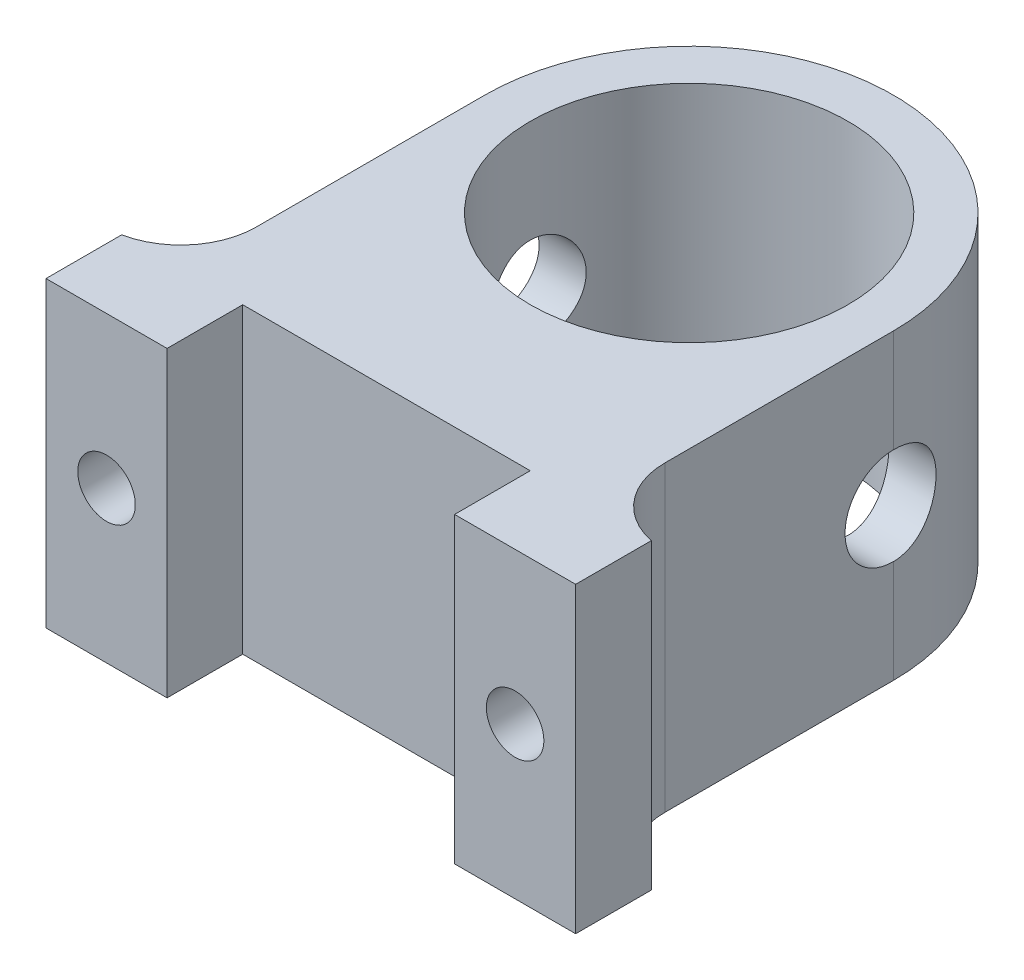
ISO-10303-21;
HEADER;
FILE_DESCRIPTION(('STEP AP214'),'2;1');
FILE_NAME('part.step','',(''),(''),'','','');
FILE_SCHEMA(('AUTOMOTIVE_DESIGN { 1 0 10303 214 1 1 1 1 }'));
ENDSEC;
DATA;
#1=APPLICATION_CONTEXT('core data for automotive mechanical design processes');
#2=APPLICATION_PROTOCOL_DEFINITION('international standard','automotive_design',2000,#1);
#3=PRODUCT_CONTEXT('',#1,'mechanical');
#4=PRODUCT('Part','Part','',(#3));
#5=PRODUCT_RELATED_PRODUCT_CATEGORY('part','',(#4));
#6=PRODUCT_DEFINITION_FORMATION('','',#4);
#7=PRODUCT_DEFINITION_CONTEXT('part definition',#1,'design');
#8=PRODUCT_DEFINITION('design','',#6,#7);
#9=PRODUCT_DEFINITION_SHAPE('','',#8);
#10=(LENGTH_UNIT() NAMED_UNIT(*) SI_UNIT(.MILLI.,.METRE.));
#11=(NAMED_UNIT(*) PLANE_ANGLE_UNIT() SI_UNIT($,.RADIAN.));
#12=(NAMED_UNIT(*) SI_UNIT($,.STERADIAN.) SOLID_ANGLE_UNIT());
#13=UNCERTAINTY_MEASURE_WITH_UNIT(LENGTH_MEASURE(1.E-05),#10,'distance_accuracy_value','');
#14=(GEOMETRIC_REPRESENTATION_CONTEXT(3) GLOBAL_UNCERTAINTY_ASSIGNED_CONTEXT((#13)) GLOBAL_UNIT_ASSIGNED_CONTEXT((#10,
#11,#12)) REPRESENTATION_CONTEXT('',''));
#15=CARTESIAN_POINT('',(0.,0.,0.));
#16=DIRECTION('',(0.,0.,1.));
#17=DIRECTION('',(1.,0.,0.));
#18=AXIS2_PLACEMENT_3D('',#15,#16,#17);
#19=CARTESIAN_POINT('',(0.,0.,20.));
#20=DIRECTION('',(0.,0.,-1.));
#21=DIRECTION('',(-1.,0.,0.));
#22=AXIS2_PLACEMENT_3D('',#19,#20,#21);
#23=PLANE('',#22);
#24=DIRECTION('',(0.,1.,0.));
#25=VECTOR('',#24,1.);
#26=CARTESIAN_POINT('',(-9.5,0.,20.));
#27=LINE('',#26,#25);
#28=CARTESIAN_POINT('',(-9.5,0.,20.));
#29=VERTEX_POINT('',#28);
#30=CARTESIAN_POINT('',(-9.5,20.,20.));
#31=VERTEX_POINT('',#30);
#32=EDGE_CURVE('E266',#29,#31,#27,.T.);
#33=ORIENTED_EDGE('',*,*,#32,.F.);
#34=DIRECTION('',(1.,0.,0.));
#35=VECTOR('',#34,1.);
#36=CARTESIAN_POINT('',(-13.5,0.,20.));
#37=LINE('',#36,#35);
#38=CARTESIAN_POINT('',(9.5,0.,20.));
#39=VERTEX_POINT('',#38);
#40=EDGE_CURVE('E159',#29,#39,#37,.T.);
#41=ORIENTED_EDGE('',*,*,#40,.T.);
#42=DIRECTION('',(0.,1.,0.));
#43=VECTOR('',#42,1.);
#44=CARTESIAN_POINT('',(9.5,0.,20.));
#45=LINE('',#44,#43);
#46=CARTESIAN_POINT('',(9.5,20.,20.));
#47=VERTEX_POINT('',#46);
#48=EDGE_CURVE('E163',#39,#47,#45,.T.);
#49=ORIENTED_EDGE('',*,*,#48,.T.);
#50=DIRECTION('',(-1.,0.,0.));
#51=VECTOR('',#50,1.);
#52=CARTESIAN_POINT('',(-13.5,20.,20.));
#53=LINE('',#52,#51);
#54=EDGE_CURVE('E268',#47,#31,#53,.T.);
#55=ORIENTED_EDGE('',*,*,#54,.T.);
#56=EDGE_LOOP('',(#33,#41,#49,#55));
#57=FACE_BOUND('',#56,.T.);
#58=ADVANCED_FACE('F34',(#57),#23,.F.);
#59=CARTESIAN_POINT('',(0.,20.,0.));
#60=DIRECTION('',(0.,-1.,0.));
#61=DIRECTION('',(0.,0.,-1.));
#62=AXIS2_PLACEMENT_3D('',#59,#60,#61);
#63=CYLINDRICAL_SURFACE('',#62,13.5);
#64=DIRECTION('',(0.,-1.,0.));
#65=VECTOR('',#64,1.);
#66=CARTESIAN_POINT('',(13.5,20.,0.));
#67=LINE('',#66,#65);
#68=CARTESIAN_POINT('',(13.5,13.2,0.));
#69=VERTEX_POINT('',#68);
#70=CARTESIAN_POINT('',(13.5,20.,0.));
#71=VERTEX_POINT('',#70);
#72=EDGE_CURVE('E321',#69,#71,#67,.F.);
#73=ORIENTED_EDGE('',*,*,#72,.F.);
#74=CARTESIAN_POINT('',(13.5,13.2,0.));
#75=CARTESIAN_POINT('',(13.5000083320501,13.2000100042,-0.0886852587947673));
#76=CARTESIAN_POINT('',(13.4991262886425,13.1963133802955,-0.177364845747361));
#77=CARTESIAN_POINT('',(13.4956432239765,13.1815844729883,-0.354066220322323));
#78=CARTESIAN_POINT('',(13.4930424525198,13.1705532556018,-0.44208810165647));
#79=CARTESIAN_POINT('',(13.4861897979492,13.1412589064264,-0.616697644474374));
#80=CARTESIAN_POINT('',(13.4819408727944,13.1230087294296,-0.703287587227378));
#81=CARTESIAN_POINT('',(13.4719161292859,13.0794429864904,-0.874556737118051));
#82=CARTESIAN_POINT('',(13.4661402980136,13.0541273607697,-0.959235928082951));
#83=CARTESIAN_POINT('',(13.446744337188,12.9678487605117,-1.20952203316342));
#84=CARTESIAN_POINT('',(13.4310491820374,12.8965275615042,-1.37153408660379));
#85=CARTESIAN_POINT('',(13.3958145376319,12.7284717290023,-1.68123236439301));
#86=CARTESIAN_POINT('',(13.3762743059093,12.6317321861243,-1.82891581371435));
#87=CARTESIAN_POINT('',(13.3350731602013,12.4136702503966,-2.10858619527846));
#88=CARTESIAN_POINT('',(13.3133824250865,12.2919664062456,-2.24027183735642));
#89=CARTESIAN_POINT('',(13.270526473027,12.0282433445359,-2.48156972224944));
#90=CARTESIAN_POINT('',(13.249361351454,11.8862204712793,-2.59117798445004));
#91=CARTESIAN_POINT('',(13.2096550650781,11.5835853552585,-2.78659598018677));
#92=CARTESIAN_POINT('',(13.1911521684306,11.4227527395293,-2.87207294370602));
#93=CARTESIAN_POINT('',(13.1593013398294,11.0885019347197,-3.0146578948584));
#94=CARTESIAN_POINT('',(13.1459524043955,10.9150862034006,-3.07177140549841));
#95=CARTESIAN_POINT('',(13.126226944591,10.5639062611777,-3.15499277901301));
#96=CARTESIAN_POINT('',(13.1197285249819,10.3862776815974,-3.18164343569772));
#97=CARTESIAN_POINT('',(13.1140744733709,10.0289569043663,-3.20487206501376));
#98=CARTESIAN_POINT('',(13.1149179413454,9.84926496235483,-3.20145372372821));
#99=CARTESIAN_POINT('',(13.1237427184024,9.49703272002236,-3.16507498805872));
#100=CARTESIAN_POINT('',(13.1315692726553,9.32442179709738,-3.1327550580648));
#101=CARTESIAN_POINT('',(13.1532324954353,8.98714581282917,-3.04050956163542));
#102=CARTESIAN_POINT('',(13.167069502272,8.82248119933837,-2.98058244126682));
#103=CARTESIAN_POINT('',(13.199341288006,8.50401535075354,-2.83425908453314));
#104=CARTESIAN_POINT('',(13.2178172406418,8.35032814120353,-2.747624139372));
#105=CARTESIAN_POINT('',(13.2572604072942,8.05944394819051,-2.550513604427));
#106=CARTESIAN_POINT('',(13.2782279516219,7.92224915599251,-2.44003485207477));
#107=CARTESIAN_POINT('',(13.3209467233843,7.66457681285003,-2.19503955447102));
#108=CARTESIAN_POINT('',(13.3427043219295,7.5446129821374,-2.05998326716042));
#109=CARTESIAN_POINT('',(13.3840744299619,7.32891625623481,-1.7713738719336));
#110=CARTESIAN_POINT('',(13.4036863807823,7.23318966325987,-1.61781596847768));
#111=CARTESIAN_POINT('',(13.4386409964678,7.06851767636019,-1.29585203566286));
#112=CARTESIAN_POINT('',(13.4539690483089,6.99966363967768,-1.12739770327588));
#113=CARTESIAN_POINT('',(13.4785048910528,6.89147784881118,-0.780964932939659));
#114=CARTESIAN_POINT('',(13.4877216596825,6.85210277777499,-0.603000882637201));
#115=CARTESIAN_POINT('',(13.4955702967153,6.81873130873499,-0.352942037388063));
#116=CARTESIAN_POINT('',(13.4972293998919,6.8117053629798,-0.28248653546079));
#117=CARTESIAN_POINT('',(13.4994435418669,6.80234522244007,-0.141365005955509));
#118=CARTESIAN_POINT('',(13.5000004129178,6.80000324138131,-0.0706995236479119));
#119=CARTESIAN_POINT('',(13.5,6.79999999999998,0.));
#120=B_SPLINE_CURVE_WITH_KNOTS('',3,(#74,#75,#76,#77,#78,#79,#80,#81,#82,#83,#84,#85,#86,#87,
#88,#89,#90,#91,#92,#93,#94,#95,#96,#97,#98,#99,#100,#101,#102,#103,#104,#105,#106,#107,#108,
#109,#110,#111,#112,#113,#114,#115,#116,#117,#118,#119),.UNSPECIFIED.,.F.,.F.,(4,2,2,2,2,2,2,2,
2,2,2,2,2,2,2,2,2,2,2,2,2,2,4),(0.,0.26596453578264,0.531890424499788,0.797341245033733,
1.06279431152429,1.59322953786724,2.1237672896412,2.66311280073636,3.20255547048416,
3.74910931037208,4.29555668207402,4.83210764322622,5.36859283085728,5.89347618413027,
6.4183890852602,6.94813667222924,7.47795456649845,8.02124302388049,8.56467260347083,
9.109933886383,9.65439237277089,9.86673551056267,10.0787253705637),.UNSPECIFIED.);
#121=CARTESIAN_POINT('',(13.5,6.8,0.));
#122=VERTEX_POINT('',#121);
#123=EDGE_CURVE('E236',#69,#122,#120,.T.);
#124=ORIENTED_EDGE('',*,*,#123,.T.);
#125=CARTESIAN_POINT('',(13.5,0.,0.));
#126=VERTEX_POINT('',#125);
#127=EDGE_CURVE('E304',#126,#122,#67,.F.);
#128=ORIENTED_EDGE('',*,*,#127,.F.);
#129=CARTESIAN_POINT('',(0.,0.,0.));
#130=DIRECTION('',(0.,1.,0.));
#131=DIRECTION('',(0.,0.,1.));
#132=AXIS2_PLACEMENT_3D('',#129,#130,#131);
#133=CIRCLE('',#132,13.5);
#134=CARTESIAN_POINT('',(-13.5,0.,0.));
#135=VERTEX_POINT('',#134);
#136=EDGE_CURVE('E295',#126,#135,#133,.T.);
#137=ORIENTED_EDGE('',*,*,#136,.T.);
#138=DIRECTION('',(0.,-1.,0.));
#139=VECTOR('',#138,1.);
#140=CARTESIAN_POINT('',(-13.5,20.,0.));
#141=LINE('',#140,#139);
#142=CARTESIAN_POINT('',(-13.5,6.8,0.));
#143=VERTEX_POINT('',#142);
#144=EDGE_CURVE('E322',#135,#143,#141,.F.);
#145=ORIENTED_EDGE('',*,*,#144,.T.);
#146=CARTESIAN_POINT('',(-13.5,6.8,0.));
#147=CARTESIAN_POINT('',(-13.5000083320501,6.79998999580003,-0.0886852587947639));
#148=CARTESIAN_POINT('',(-13.4991262886425,6.80368661970454,-0.177364845747357));
#149=CARTESIAN_POINT('',(-13.4956432239765,6.81841552701169,-0.35406622032232));
#150=CARTESIAN_POINT('',(-13.4930424525198,6.82944674439824,-0.442088101656468));
#151=CARTESIAN_POINT('',(-13.4861897979492,6.85874109357356,-0.616697644474371));
#152=CARTESIAN_POINT('',(-13.4819408727944,6.87699127057037,-0.703287587227375));
#153=CARTESIAN_POINT('',(-13.4719161292859,6.92055701350958,-0.874556737118048));
#154=CARTESIAN_POINT('',(-13.4661402980136,6.94587263923032,-0.959235928082949));
#155=CARTESIAN_POINT('',(-13.446744337188,7.03215123948827,-1.20952203316342));
#156=CARTESIAN_POINT('',(-13.4310491820374,7.10347243849578,-1.37153408660379));
#157=CARTESIAN_POINT('',(-13.3958145376319,7.27152827099773,-1.68123236439301));
#158=CARTESIAN_POINT('',(-13.3762743059093,7.36826781387574,-1.82891581371435));
#159=CARTESIAN_POINT('',(-13.3350731602013,7.58632974960342,-2.10858619527845));
#160=CARTESIAN_POINT('',(-13.3133824250865,7.7080335937544,-2.24027183735642));
#161=CARTESIAN_POINT('',(-13.270526473027,7.97175665546414,-2.48156972224944));
#162=CARTESIAN_POINT('',(-13.249361351454,8.11377952872073,-2.59117798445004));
#163=CARTESIAN_POINT('',(-13.2096550650781,8.41641464474148,-2.78659598018677));
#164=CARTESIAN_POINT('',(-13.1911521684306,8.57724726047071,-2.87207294370602));
#165=CARTESIAN_POINT('',(-13.1593013398294,8.91149806528025,-3.0146578948584));
#166=CARTESIAN_POINT('',(-13.1459524043955,9.08491379659936,-3.07177140549841));
#167=CARTESIAN_POINT('',(-13.126226944591,9.43609373882233,-3.15499277901301));
#168=CARTESIAN_POINT('',(-13.1197285249819,9.61372231840255,-3.18164343569772));
#169=CARTESIAN_POINT('',(-13.1140744733709,9.97104309563372,-3.20487206501376));
#170=CARTESIAN_POINT('',(-13.1149179413454,10.1507350376452,-3.20145372372821));
#171=CARTESIAN_POINT('',(-13.1237427184024,10.5029672799776,-3.16507498805872));
#172=CARTESIAN_POINT('',(-13.1315692726553,10.6755782029026,-3.1327550580648));
#173=CARTESIAN_POINT('',(-13.1532324954353,11.0128541871708,-3.04050956163542));
#174=CARTESIAN_POINT('',(-13.167069502272,11.1775188006616,-2.98058244126683));
#175=CARTESIAN_POINT('',(-13.199341288006,11.4959846492465,-2.83425908453314));
#176=CARTESIAN_POINT('',(-13.2178172406418,11.6496718587965,-2.74762413937201));
#177=CARTESIAN_POINT('',(-13.2572604072942,11.9405560518095,-2.550513604427));
#178=CARTESIAN_POINT('',(-13.2782279516219,12.0777508440075,-2.44003485207477));
#179=CARTESIAN_POINT('',(-13.3209467233843,12.33542318715,-2.19503955447102));
#180=CARTESIAN_POINT('',(-13.3427043219295,12.4553870178626,-2.05998326716042));
#181=CARTESIAN_POINT('',(-13.3840744299619,12.6710837437652,-1.77137387193361));
#182=CARTESIAN_POINT('',(-13.4036863807823,12.7668103367401,-1.61781596847768));
#183=CARTESIAN_POINT('',(-13.4386409964678,12.9314823236398,-1.29585203566286));
#184=CARTESIAN_POINT('',(-13.4539690483089,13.0003363603223,-1.12739770327588));
#185=CARTESIAN_POINT('',(-13.4785048910528,13.1085221511888,-0.780964932939662));
#186=CARTESIAN_POINT('',(-13.4877216596825,13.147897222225,-0.603000882637204));
#187=CARTESIAN_POINT('',(-13.4955702967153,13.181268691265,-0.352942037388065));
#188=CARTESIAN_POINT('',(-13.4972293998919,13.1882946370202,-0.282486535460791));
#189=CARTESIAN_POINT('',(-13.4994435418669,13.1976547775599,-0.141365005955508));
#190=CARTESIAN_POINT('',(-13.5000004129178,13.1999967586187,-0.0706995236479095));
#191=CARTESIAN_POINT('',(-13.5,13.2,0.));
#192=B_SPLINE_CURVE_WITH_KNOTS('',3,(#146,#147,#148,#149,#150,#151,#152,#153,#154,#155,#156,
#157,#158,#159,#160,#161,#162,#163,#164,#165,#166,#167,#168,#169,#170,#171,#172,#173,#174,#175,
#176,#177,#178,#179,#180,#181,#182,#183,#184,#185,#186,#187,#188,#189,#190,#191),.UNSPECIFIED.,
.F.,.F.,(4,2,2,2,2,2,2,2,2,2,2,2,2,2,2,2,2,2,2,2,2,2,4),(0.,0.26596453578264,0.531890424499788,
0.797341245033734,1.06279431152429,1.59322953786724,2.1237672896412,2.66311280073636,
3.20255547048416,3.74910931037208,4.29555668207401,4.83210764322622,5.36859283085728,
5.89347618413027,6.4183890852602,6.94813667222924,7.47795456649845,8.0212430238805,
8.56467260347083,9.10993388638299,9.65439237277089,9.86673551056268,10.0787253705637),.UNSPECIFIED.);
#193=CARTESIAN_POINT('',(-13.5,13.2,0.));
#194=VERTEX_POINT('',#193);
#195=EDGE_CURVE('E229',#143,#194,#192,.T.);
#196=ORIENTED_EDGE('',*,*,#195,.T.);
#197=CARTESIAN_POINT('',(-13.5,20.,0.));
#198=VERTEX_POINT('',#197);
#199=EDGE_CURVE('E317',#194,#198,#141,.F.);
#200=ORIENTED_EDGE('',*,*,#199,.T.);
#201=CARTESIAN_POINT('',(0.,20.,0.));
#202=DIRECTION('',(0.,1.,0.));
#203=DIRECTION('',(0.,0.,1.));
#204=AXIS2_PLACEMENT_3D('',#201,#202,#203);
#205=CIRCLE('',#204,13.5);
#206=EDGE_CURVE('E294',#71,#198,#205,.T.);
#207=ORIENTED_EDGE('',*,*,#206,.F.);
#208=EDGE_LOOP('',(#73,#124,#128,#137,#145,#196,#200,#207));
#209=FACE_BOUND('',#208,.T.);
#210=ADVANCED_FACE('F242',(#209),#63,.T.);
#211=CARTESIAN_POINT('',(0.,20.,0.));
#212=DIRECTION('',(0.,1.,0.));
#213=DIRECTION('',(0.,0.,1.));
#214=AXIS2_PLACEMENT_3D('',#211,#212,#213);
#215=PLANE('',#214);
#216=ORIENTED_EDGE('',*,*,#206,.T.);
#217=DIRECTION('',(0.,0.,1.));
#218=VECTOR('',#217,1.);
#219=CARTESIAN_POINT('',(-13.5,20.,-13.501));
#220=LINE('',#219,#218);
#221=CARTESIAN_POINT('',(-13.5,20.,15.1010205144336));
#222=VERTEX_POINT('',#221);
#223=EDGE_CURVE('E310',#198,#222,#220,.T.);
#224=ORIENTED_EDGE('',*,*,#223,.T.);
#225=CARTESIAN_POINT('',(-18.5,20.,15.1010205144336));
#226=DIRECTION('',(0.,1.,0.));
#227=DIRECTION('',(0.,0.,1.));
#228=AXIS2_PLACEMENT_3D('',#225,#226,#227);
#229=CIRCLE('',#228,5.);
#230=CARTESIAN_POINT('',(-17.5,20.,20.));
#231=VERTEX_POINT('',#230);
#232=EDGE_CURVE('E11',#222,#231,#229,.F.);
#233=ORIENTED_EDGE('',*,*,#232,.T.);
#234=DIRECTION('',(0.,0.,-1.));
#235=VECTOR('',#234,1.);
#236=CARTESIAN_POINT('',(-17.5,20.,25.));
#237=LINE('',#236,#235);
#238=CARTESIAN_POINT('',(-17.5,20.,25.));
#239=VERTEX_POINT('',#238);
#240=EDGE_CURVE('E165',#239,#231,#237,.T.);
#241=ORIENTED_EDGE('',*,*,#240,.F.);
#242=DIRECTION('',(-1.,0.,0.));
#243=VECTOR('',#242,1.);
#244=CARTESIAN_POINT('',(0.,20.,25.));
#245=LINE('',#244,#243);
#246=CARTESIAN_POINT('',(-9.5,20.,25.));
#247=VERTEX_POINT('',#246);
#248=EDGE_CURVE('E144',#247,#239,#245,.T.);
#249=ORIENTED_EDGE('',*,*,#248,.F.);
#250=DIRECTION('',(0.,0.,-1.));
#251=VECTOR('',#250,1.);
#252=CARTESIAN_POINT('',(-9.5,20.,25.));
#253=LINE('',#252,#251);
#254=EDGE_CURVE('E141',#247,#31,#253,.T.);
#255=ORIENTED_EDGE('',*,*,#254,.T.);
#256=ORIENTED_EDGE('',*,*,#54,.F.);
#257=DIRECTION('',(0.,0.,-1.));
#258=VECTOR('',#257,1.);
#259=CARTESIAN_POINT('',(9.5,20.,25.));
#260=LINE('',#259,#258);
#261=CARTESIAN_POINT('',(9.5,20.,25.));
#262=VERTEX_POINT('',#261);
#263=EDGE_CURVE('E187',#262,#47,#260,.T.);
#264=ORIENTED_EDGE('',*,*,#263,.F.);
#265=DIRECTION('',(-1.,0.,0.));
#266=VECTOR('',#265,1.);
#267=CARTESIAN_POINT('',(0.,20.,25.));
#268=LINE('',#267,#266);
#269=CARTESIAN_POINT('',(17.5,20.,25.));
#270=VERTEX_POINT('',#269);
#271=EDGE_CURVE('E172',#270,#262,#268,.T.);
#272=ORIENTED_EDGE('',*,*,#271,.F.);
#273=DIRECTION('',(0.,0.,-1.));
#274=VECTOR('',#273,1.);
#275=CARTESIAN_POINT('',(17.5,20.,25.));
#276=LINE('',#275,#274);
#277=CARTESIAN_POINT('',(17.5,20.,20.));
#278=VERTEX_POINT('',#277);
#279=EDGE_CURVE('E189',#270,#278,#276,.T.);
#280=ORIENTED_EDGE('',*,*,#279,.T.);
#281=CARTESIAN_POINT('',(18.5,20.,15.1010205144336));
#282=DIRECTION('',(0.,1.,0.));
#283=DIRECTION('',(0.,0.,1.));
#284=AXIS2_PLACEMENT_3D('',#281,#282,#283);
#285=CIRCLE('',#284,5.);
#286=CARTESIAN_POINT('',(13.5,20.,15.1010205144336));
#287=VERTEX_POINT('',#286);
#288=EDGE_CURVE('E287',#278,#287,#285,.F.);
#289=ORIENTED_EDGE('',*,*,#288,.T.);
#290=DIRECTION('',(0.,0.,1.));
#291=VECTOR('',#290,1.);
#292=CARTESIAN_POINT('',(13.5,20.,-13.501));
#293=LINE('',#292,#291);
#294=EDGE_CURVE('E307',#71,#287,#293,.T.);
#295=ORIENTED_EDGE('',*,*,#294,.F.);
#296=EDGE_LOOP('',(#216,#224,#233,#241,#249,#255,#256,#264,#272,#280,#289,#295));
#297=FACE_BOUND('',#296,.T.);
#298=CARTESIAN_POINT('',(0.,20.,0.));
#299=DIRECTION('',(0.,1.,0.));
#300=DIRECTION('',(0.,0.,1.));
#301=AXIS2_PLACEMENT_3D('',#298,#299,#300);
#302=CIRCLE('',#301,10.5);
#303=CARTESIAN_POINT('',(0.,20.,10.5));
#304=VERTEX_POINT('',#303);
#305=EDGE_CURVE('E298',#304,#304,#302,.T.);
#306=ORIENTED_EDGE('',*,*,#305,.F.);
#307=EDGE_LOOP('',(#306));
#308=FACE_BOUND('',#307,.T.);
#309=ADVANCED_FACE('F246',(#297,#308),#215,.T.);
#310=CARTESIAN_POINT('',(0.,0.,0.));
#311=DIRECTION('',(0.,1.,0.));
#312=DIRECTION('',(0.,0.,1.));
#313=AXIS2_PLACEMENT_3D('',#310,#311,#312);
#314=PLANE('',#313);
#315=ORIENTED_EDGE('',*,*,#136,.F.);
#316=DIRECTION('',(0.,0.,1.));
#317=VECTOR('',#316,1.);
#318=CARTESIAN_POINT('',(13.5,0.,-13.501));
#319=LINE('',#318,#317);
#320=CARTESIAN_POINT('',(13.5,0.,15.1010205144336));
#321=VERTEX_POINT('',#320);
#322=EDGE_CURVE('E314',#126,#321,#319,.T.);
#323=ORIENTED_EDGE('',*,*,#322,.T.);
#324=CARTESIAN_POINT('',(18.5,0.,15.1010205144336));
#325=DIRECTION('',(0.,1.,0.));
#326=DIRECTION('',(0.,0.,1.));
#327=AXIS2_PLACEMENT_3D('',#324,#325,#326);
#328=CIRCLE('',#327,5.);
#329=CARTESIAN_POINT('',(17.5,0.,20.));
#330=VERTEX_POINT('',#329);
#331=EDGE_CURVE('E286',#321,#330,#328,.T.);
#332=ORIENTED_EDGE('',*,*,#331,.T.);
#333=DIRECTION('',(0.,0.,-1.));
#334=VECTOR('',#333,1.);
#335=CARTESIAN_POINT('',(17.5,0.,25.));
#336=LINE('',#335,#334);
#337=CARTESIAN_POINT('',(17.5,0.,25.));
#338=VERTEX_POINT('',#337);
#339=EDGE_CURVE('E179',#338,#330,#336,.T.);
#340=ORIENTED_EDGE('',*,*,#339,.F.);
#341=DIRECTION('',(-1.,0.,0.));
#342=VECTOR('',#341,1.);
#343=CARTESIAN_POINT('',(0.,0.,25.));
#344=LINE('',#343,#342);
#345=CARTESIAN_POINT('',(9.5,0.,25.));
#346=VERTEX_POINT('',#345);
#347=EDGE_CURVE('E177',#338,#346,#344,.T.);
#348=ORIENTED_EDGE('',*,*,#347,.T.);
#349=DIRECTION('',(0.,0.,-1.));
#350=VECTOR('',#349,1.);
#351=CARTESIAN_POINT('',(9.5,0.,25.));
#352=LINE('',#351,#350);
#353=EDGE_CURVE('E185',#346,#39,#352,.T.);
#354=ORIENTED_EDGE('',*,*,#353,.T.);
#355=ORIENTED_EDGE('',*,*,#40,.F.);
#356=DIRECTION('',(0.,0.,-1.));
#357=VECTOR('',#356,1.);
#358=CARTESIAN_POINT('',(-9.5,0.,25.));
#359=LINE('',#358,#357);
#360=CARTESIAN_POINT('',(-9.5,0.,25.));
#361=VERTEX_POINT('',#360);
#362=EDGE_CURVE('E139',#361,#29,#359,.T.);
#363=ORIENTED_EDGE('',*,*,#362,.F.);
#364=DIRECTION('',(1.,0.,0.));
#365=VECTOR('',#364,1.);
#366=CARTESIAN_POINT('',(0.,0.,25.));
#367=LINE('',#366,#365);
#368=CARTESIAN_POINT('',(-17.5,0.,25.));
#369=VERTEX_POINT('',#368);
#370=EDGE_CURVE('E145',#369,#361,#367,.T.);
#371=ORIENTED_EDGE('',*,*,#370,.F.);
#372=DIRECTION('',(0.,0.,-1.));
#373=VECTOR('',#372,1.);
#374=CARTESIAN_POINT('',(-17.5,0.,25.));
#375=LINE('',#374,#373);
#376=CARTESIAN_POINT('',(-17.5,0.,20.));
#377=VERTEX_POINT('',#376);
#378=EDGE_CURVE('E279',#369,#377,#375,.T.);
#379=ORIENTED_EDGE('',*,*,#378,.T.);
#380=CARTESIAN_POINT('',(-18.5,0.,15.1010205144336));
#381=DIRECTION('',(0.,1.,0.));
#382=DIRECTION('',(0.,0.,1.));
#383=AXIS2_PLACEMENT_3D('',#380,#381,#382);
#384=CIRCLE('',#383,5.);
#385=CARTESIAN_POINT('',(-13.5,0.,15.1010205144336));
#386=VERTEX_POINT('',#385);
#387=EDGE_CURVE('E42',#377,#386,#384,.T.);
#388=ORIENTED_EDGE('',*,*,#387,.T.);
#389=DIRECTION('',(0.,0.,1.));
#390=VECTOR('',#389,1.);
#391=CARTESIAN_POINT('',(-13.5,0.,-13.501));
#392=LINE('',#391,#390);
#393=EDGE_CURVE('E312',#135,#386,#392,.T.);
#394=ORIENTED_EDGE('',*,*,#393,.F.);
#395=EDGE_LOOP('',(#315,#323,#332,#340,#348,#354,#355,#363,#371,#379,#388,#394));
#396=FACE_BOUND('',#395,.T.);
#397=CARTESIAN_POINT('',(0.,0.,0.));
#398=DIRECTION('',(0.,1.,0.));
#399=DIRECTION('',(0.,0.,1.));
#400=AXIS2_PLACEMENT_3D('',#397,#398,#399);
#401=CIRCLE('',#400,10.5);
#402=CARTESIAN_POINT('',(0.,0.,10.5));
#403=VERTEX_POINT('',#402);
#404=EDGE_CURVE('E301',#403,#403,#401,.T.);
#405=ORIENTED_EDGE('',*,*,#404,.T.);
#406=EDGE_LOOP('',(#405));
#407=FACE_BOUND('',#406,.T.);
#408=ADVANCED_FACE('F156',(#396,#407),#314,.F.);
#409=CARTESIAN_POINT('',(0.,20.,0.));
#410=DIRECTION('',(0.,-1.,0.));
#411=DIRECTION('',(0.,0.,-1.));
#412=AXIS2_PLACEMENT_3D('',#409,#410,#411);
#413=CYLINDRICAL_SURFACE('',#412,10.5);
#414=CARTESIAN_POINT('',(-10.0004999875006,10.,-3.2));
#415=CARTESIAN_POINT('',(-10.0005015412404,10.1752055722159,-3.1999981809446));
#416=CARTESIAN_POINT('',(-10.0051546881166,10.3504291533792,-3.18556187906965));
#417=CARTESIAN_POINT('',(-10.0231871901999,10.6957440742788,-3.12835303875271));
#418=CARTESIAN_POINT('',(-10.0365692487182,10.8658338070021,-3.08557172190088));
#419=CARTESIAN_POINT('',(-10.0704062048734,11.1958310152594,-2.97326795418971));
#420=CARTESIAN_POINT('',(-10.0908490511685,11.3557552940154,-2.90379104474801));
#421=CARTESIAN_POINT('',(-10.1364877140457,11.661719249625,-2.74021882266113));
#422=CARTESIAN_POINT('',(-10.1616842909241,11.8077566998373,-2.64611957106565));
#423=CARTESIAN_POINT('',(-10.2149144543509,12.08657173636,-2.43268266168986));
#424=CARTESIAN_POINT('',(-10.2430099447274,12.2188288040356,-2.3126803262075));
#425=CARTESIAN_POINT('',(-10.2983442542131,12.4616874423642,-2.05226728728892));
#426=CARTESIAN_POINT('',(-10.3255829592884,12.572286140549,-1.91185388110586));
#427=CARTESIAN_POINT('',(-10.3768396566062,12.770962623587,-1.61088747685902));
#428=CARTESIAN_POINT('',(-10.400776229578,12.8585076758,-1.44996772510436));
#429=CARTESIAN_POINT('',(-10.4420110584187,13.0050903588696,-1.11483598994642));
#430=CARTESIAN_POINT('',(-10.4593107940362,13.0641343450799,-0.940626979911302));
#431=CARTESIAN_POINT('',(-10.4848846668623,13.1503104894022,-0.589309183873519));
#432=CARTESIAN_POINT('',(-10.4934096961389,13.1783315696377,-0.412437039923502));
#433=CARTESIAN_POINT('',(-10.5013581299503,13.204479415036,-0.0563101632015265));
#434=CARTESIAN_POINT('',(-10.5007835053233,13.2026126534224,0.122944045250573));
#435=CARTESIAN_POINT('',(-10.4907737236302,13.1696299955793,0.472502875225446));
#436=CARTESIAN_POINT('',(-10.481630302254,13.1394771033856,0.642908038455457));
#437=CARTESIAN_POINT('',(-10.4558664538359,13.0523538380061,0.976113145529361));
#438=CARTESIAN_POINT('',(-10.4392455476749,12.9953817463722,1.13891260130042));
#439=CARTESIAN_POINT('',(-10.3999953714333,12.8555978551837,1.45454879646396));
#440=CARTESIAN_POINT('',(-10.3772970872065,12.7724872053986,1.60724425006628));
#441=CARTESIAN_POINT('',(-10.3282937056556,12.5830230476249,1.89682623117214));
#442=CARTESIAN_POINT('',(-10.3019877316224,12.4766638862443,2.03370890104959));
#443=CARTESIAN_POINT('',(-10.2473449677536,12.2387462479822,2.2935250785121));
#444=CARTESIAN_POINT('',(-10.2189690167752,12.1063545150405,2.41568836134003));
#445=CARTESIAN_POINT('',(-10.1642937406792,11.8226912508678,2.63630128333586));
#446=CARTESIAN_POINT('',(-10.1379946361094,11.6714177189007,2.73474840626956));
#447=CARTESIAN_POINT('',(-10.0902596310521,11.3522013487143,2.90597236586795));
#448=CARTESIAN_POINT('',(-10.068875932235,11.1841045723052,2.97847783657543));
#449=CARTESIAN_POINT('',(-10.0340094895293,10.8372816666325,3.0939185347097));
#450=CARTESIAN_POINT('',(-10.0205240708032,10.6585591584994,3.1368637738905));
#451=CARTESIAN_POINT('',(-10.0035706381858,10.3029070503265,3.1905078661248));
#452=CARTESIAN_POINT('',(-9.99973810650724,10.1261717871109,3.2023807993672));
#453=CARTESIAN_POINT('',(-10.0015148713607,9.77322658034793,3.19682847321544));
#454=CARTESIAN_POINT('',(-10.0071227952465,9.59701656416119,3.17940747317182));
#455=CARTESIAN_POINT('',(-10.0267900318207,9.25507994410004,3.11680880360055));
#456=CARTESIAN_POINT('',(-10.0406164523494,9.08919867789877,3.07239528496834));
#457=CARTESIAN_POINT('',(-10.0749194443055,8.76725650477988,2.95796255017949));
#458=CARTESIAN_POINT('',(-10.0953970646094,8.6111971513887,2.88793929521547));
#459=CARTESIAN_POINT('',(-10.1413958602948,8.3085745924692,2.72207104652071));
#460=CARTESIAN_POINT('',(-10.167040405468,8.16239128156755,2.62556802255422));
#461=CARTESIAN_POINT('',(-10.2202221868681,7.88786492616184,2.41025603933945));
#462=CARTESIAN_POINT('',(-10.2477598896514,7.75952630308915,2.29144156899796));
#463=CARTESIAN_POINT('',(-10.3029290512819,7.51915629999367,2.02934629522093));
#464=CARTESIAN_POINT('',(-10.3305220234022,7.40795941209138,1.88529011504185));
#465=CARTESIAN_POINT('',(-10.3816108654789,7.21129261014641,1.57990125062946));
#466=CARTESIAN_POINT('',(-10.4051069336225,7.12582145147975,1.41856940271399));
#467=CARTESIAN_POINT('',(-10.4452142601495,6.98385649840703,1.08425064593095));
#468=CARTESIAN_POINT('',(-10.4618762732589,6.92714831468792,0.911361174612131));
#469=CARTESIAN_POINT('',(-10.4866619994667,6.84378628633455,0.557905400433759));
#470=CARTESIAN_POINT('',(-10.4947882411776,6.81712354095485,0.377341387559536));
#471=CARTESIAN_POINT('',(-10.5014277410478,6.7953036386917,0.0213624389707485));
#472=CARTESIAN_POINT('',(-10.5003097013496,6.79893814449267,-0.15397245863204));
#473=CARTESIAN_POINT('',(-10.4894605885057,6.83470836074272,-0.501422979373127));
#474=CARTESIAN_POINT('',(-10.4797300308349,6.86684236544433,-0.673538794549917));
#475=CARTESIAN_POINT('',(-10.4528587283373,6.95794323782583,-1.0077496423151));
#476=CARTESIAN_POINT('',(-10.4358036479583,7.01660031020172,-1.16993648271147));
#477=CARTESIAN_POINT('',(-10.3960448609949,7.15880422828839,-1.48224897728653));
#478=CARTESIAN_POINT('',(-10.3733402100525,7.2423552356232,-1.63237260947571));
#479=CARTESIAN_POINT('',(-10.3237371293278,7.43514364051419,-1.92164106145041));
#480=CARTESIAN_POINT('',(-10.2967257420756,7.54513238012545,-2.06026558974965));
#481=CARTESIAN_POINT('',(-10.2419019802868,7.78633158549168,-2.31749311793802));
#482=CARTESIAN_POINT('',(-10.2140893736655,7.91754825207085,-2.4360902469339));
#483=CARTESIAN_POINT('',(-10.1597922997048,8.20236532643129,-2.65360119052192));
#484=CARTESIAN_POINT('',(-10.1333758740524,8.35653419068235,-2.75178959793191));
#485=CARTESIAN_POINT('',(-10.085979625594,8.67996503948494,-2.92074627368278));
#486=CARTESIAN_POINT('',(-10.0649973450952,8.84922015428011,-2.99152694487696));
#487=CARTESIAN_POINT('',(-10.0327867147767,9.18069856943069,-3.09773479999514));
#488=CARTESIAN_POINT('',(-10.0207963440323,9.34194951863558,-3.13597599178226));
#489=CARTESIAN_POINT('',(-10.0046530961519,9.66879558194037,-3.18710670175884));
#490=CARTESIAN_POINT('',(-10.0004985188531,9.83438974576821,-3.20000171943291));
#491=CARTESIAN_POINT('',(-10.0004999875006,10.,-3.2));
#492=B_SPLINE_CURVE_WITH_KNOTS('',3,(#414,#415,#416,#417,#418,#419,#420,#421,#422,#423,#424,
#425,#426,#427,#428,#429,#430,#431,#432,#433,#434,#435,#436,#437,#438,#439,#440,#441,#442,#443,
#444,#445,#446,#447,#448,#449,#450,#451,#452,#453,#454,#455,#456,#457,#458,#459,#460,#461,#462,
#463,#464,#465,#466,#467,#468,#469,#470,#471,#472,#473,#474,#475,#476,#477,#478,#479,#480,#481,
#482,#483,#484,#485,#486,#487,#488,#489,#490,#491),.UNSPECIFIED.,.T.,.F.,(4,2,2,2,2,2,2,2,2,2,2,
2,2,2,2,2,2,2,2,2,2,2,2,2,2,2,2,2,2,2,2,2,2,2,2,2,2,2,4),(0.,0.525005488396942,1.05017364627747,
1.57444984156032,2.09880995906927,2.63869291914907,3.17864743345729,3.73015965511806,
4.28154884010902,4.81669325714867,5.35172177212149,5.86917176784707,6.38665492384785,
6.91028398808263,7.43404052628863,7.97860504580142,8.52322731703243,9.07339069679332,
9.62336764992629,10.1522417446257,10.6810389474527,11.1955213887743,11.710085002041,
12.238819903369,12.7676855783515,13.3172434215958,13.8667746726743,14.4121473898664,
14.9573585017972,15.4809323695507,16.0044749025593,16.5220542826455,17.0397202372528,
17.5743327468447,18.1091017033565,18.6604732683566,19.211595028157,19.7079557468923,
20.2042087558968),.UNSPECIFIED.);
#493=CARTESIAN_POINT('',(-10.0004999875006,10.,-3.2));
#494=VERTEX_POINT('',#493);
#495=EDGE_CURVE('E205',#494,#494,#492,.T.);
#496=ORIENTED_EDGE('',*,*,#495,.F.);
#497=EDGE_LOOP('',(#496));
#498=FACE_BOUND('',#497,.T.);
#499=CARTESIAN_POINT('',(10.0004999875006,10.,-3.2));
#500=CARTESIAN_POINT('',(10.0005015412404,9.82479442778409,-3.1999981809446));
#501=CARTESIAN_POINT('',(10.0051546881166,9.64957084662084,-3.18556187906965));
#502=CARTESIAN_POINT('',(10.0231871901999,9.30425592572118,-3.12835303875271));
#503=CARTESIAN_POINT('',(10.0365692487182,9.13416619299786,-3.08557172190088));
#504=CARTESIAN_POINT('',(10.0704062048734,8.80416898474059,-2.97326795418971));
#505=CARTESIAN_POINT('',(10.0908490511685,8.64424470598464,-2.90379104474801));
#506=CARTESIAN_POINT('',(10.1364877140457,8.33828075037501,-2.74021882266113));
#507=CARTESIAN_POINT('',(10.1616842909241,8.1922433001627,-2.64611957106565));
#508=CARTESIAN_POINT('',(10.2149144543509,7.91342826364004,-2.43268266168986));
#509=CARTESIAN_POINT('',(10.2430099447274,7.78117119596442,-2.3126803262075));
#510=CARTESIAN_POINT('',(10.2983442542131,7.53831255763578,-2.05226728728892));
#511=CARTESIAN_POINT('',(10.3255829592884,7.427713859451,-1.91185388110586));
#512=CARTESIAN_POINT('',(10.3768396566062,7.22903737641301,-1.61088747685902));
#513=CARTESIAN_POINT('',(10.400776229578,7.14149232419998,-1.44996772510436));
#514=CARTESIAN_POINT('',(10.4420110584187,6.99490964113036,-1.11483598994642));
#515=CARTESIAN_POINT('',(10.4593107940362,6.93586565492008,-0.940626979911301));
#516=CARTESIAN_POINT('',(10.4848846668623,6.84968951059781,-0.589309183873518));
#517=CARTESIAN_POINT('',(10.4934096961389,6.82166843036229,-0.412437039923501));
#518=CARTESIAN_POINT('',(10.5013581299503,6.79552058496404,-0.0563101632015261));
#519=CARTESIAN_POINT('',(10.5007835053233,6.79738734657763,0.122944045250574));
#520=CARTESIAN_POINT('',(10.4907737236302,6.83037000442068,0.472502875225446));
#521=CARTESIAN_POINT('',(10.481630302254,6.86052289661439,0.642908038455457));
#522=CARTESIAN_POINT('',(10.4558664538359,6.94764616199389,0.976113145529361));
#523=CARTESIAN_POINT('',(10.4392455476749,7.00461825362779,1.13891260130042));
#524=CARTESIAN_POINT('',(10.3999953714333,7.14440214481631,1.45454879646396));
#525=CARTESIAN_POINT('',(10.3772970872065,7.22751279460138,1.60724425006628));
#526=CARTESIAN_POINT('',(10.3282937056556,7.41697695237513,1.89682623117214));
#527=CARTESIAN_POINT('',(10.3019877316224,7.52333611375568,2.03370890104959));
#528=CARTESIAN_POINT('',(10.2473449677536,7.76125375201776,2.29352507851211));
#529=CARTESIAN_POINT('',(10.2189690167752,7.89364548495951,2.41568836134003));
#530=CARTESIAN_POINT('',(10.1642937406792,8.17730874913218,2.63630128333586));
#531=CARTESIAN_POINT('',(10.1379946361094,8.32858228109929,2.73474840626956));
#532=CARTESIAN_POINT('',(10.0902596310521,8.64779865128568,2.90597236586795));
#533=CARTESIAN_POINT('',(10.068875932235,8.81589542769484,2.97847783657543));
#534=CARTESIAN_POINT('',(10.0340094895293,9.16271833336755,3.0939185347097));
#535=CARTESIAN_POINT('',(10.0205240708032,9.34144084150057,3.1368637738905));
#536=CARTESIAN_POINT('',(10.0035706381858,9.69709294967355,3.1905078661248));
#537=CARTESIAN_POINT('',(9.99973810650724,9.87382821288911,3.2023807993672));
#538=CARTESIAN_POINT('',(10.0015148713607,10.2267734196521,3.19682847321544));
#539=CARTESIAN_POINT('',(10.0071227952465,10.4029834358388,3.17940747317182));
#540=CARTESIAN_POINT('',(10.0267900318207,10.7449200559,3.11680880360055));
#541=CARTESIAN_POINT('',(10.0406164523494,10.9108013221012,3.07239528496834));
#542=CARTESIAN_POINT('',(10.0749194443055,11.2327434952201,2.95796255017949));
#543=CARTESIAN_POINT('',(10.0953970646094,11.3888028486113,2.88793929521547));
#544=CARTESIAN_POINT('',(10.1413958602948,11.6914254075308,2.72207104652071));
#545=CARTESIAN_POINT('',(10.167040405468,11.8376087184324,2.62556802255422));
#546=CARTESIAN_POINT('',(10.2202221868681,12.1121350738382,2.41025603933945));
#547=CARTESIAN_POINT('',(10.2477598896514,12.2404736969108,2.29144156899796));
#548=CARTESIAN_POINT('',(10.3029290512819,12.4808437000063,2.02934629522093));
#549=CARTESIAN_POINT('',(10.3305220234022,12.5920405879086,1.88529011504185));
#550=CARTESIAN_POINT('',(10.3816108654789,12.7887073898536,1.57990125062946));
#551=CARTESIAN_POINT('',(10.4051069336225,12.8741785485203,1.41856940271399));
#552=CARTESIAN_POINT('',(10.4452142601495,13.016143501593,1.08425064593094));
#553=CARTESIAN_POINT('',(10.4618762732589,13.0728516853121,0.911361174612129));
#554=CARTESIAN_POINT('',(10.4866619994667,13.1562137136654,0.557905400433758));
#555=CARTESIAN_POINT('',(10.4947882411776,13.1828764590452,0.377341387559535));
#556=CARTESIAN_POINT('',(10.5014277410478,13.2046963613083,0.0213624389707481));
#557=CARTESIAN_POINT('',(10.5003097013496,13.2010618555073,-0.15397245863204));
#558=CARTESIAN_POINT('',(10.4894605885057,13.1652916392573,-0.501422979373127));
#559=CARTESIAN_POINT('',(10.4797300308349,13.1331576345557,-0.673538794549918));
#560=CARTESIAN_POINT('',(10.4528587283373,13.0420567621742,-1.0077496423151));
#561=CARTESIAN_POINT('',(10.4358036479583,12.9833996897983,-1.16993648271148));
#562=CARTESIAN_POINT('',(10.3960448609949,12.8411957717116,-1.48224897728653));
#563=CARTESIAN_POINT('',(10.3733402100525,12.7576447643768,-1.63237260947571));
#564=CARTESIAN_POINT('',(10.3237371293278,12.5648563594858,-1.92164106145041));
#565=CARTESIAN_POINT('',(10.2967257420756,12.4548676198745,-2.06026558974965));
#566=CARTESIAN_POINT('',(10.2419019802868,12.2136684145083,-2.31749311793802));
#567=CARTESIAN_POINT('',(10.2140893736655,12.0824517479292,-2.43609024693391));
#568=CARTESIAN_POINT('',(10.1597922997048,11.7976346735687,-2.65360119052192));
#569=CARTESIAN_POINT('',(10.1333758740524,11.6434658093177,-2.75178959793191));
#570=CARTESIAN_POINT('',(10.085979625594,11.3200349605151,-2.92074627368278));
#571=CARTESIAN_POINT('',(10.0649973450952,11.1507798457199,-2.99152694487696));
#572=CARTESIAN_POINT('',(10.0327867147767,10.8193014305693,-3.09773479999514));
#573=CARTESIAN_POINT('',(10.0207963440323,10.6580504813644,-3.13597599178226));
#574=CARTESIAN_POINT('',(10.0046530961519,10.3312044180596,-3.18710670175884));
#575=CARTESIAN_POINT('',(10.0004985188531,10.1656102542318,-3.20000171943291));
#576=CARTESIAN_POINT('',(10.0004999875006,10.,-3.2));
#577=B_SPLINE_CURVE_WITH_KNOTS('',3,(#499,#500,#501,#502,#503,#504,#505,#506,#507,#508,#509,
#510,#511,#512,#513,#514,#515,#516,#517,#518,#519,#520,#521,#522,#523,#524,#525,#526,#527,#528,
#529,#530,#531,#532,#533,#534,#535,#536,#537,#538,#539,#540,#541,#542,#543,#544,#545,#546,#547,
#548,#549,#550,#551,#552,#553,#554,#555,#556,#557,#558,#559,#560,#561,#562,#563,#564,#565,#566,
#567,#568,#569,#570,#571,#572,#573,#574,#575,#576),.UNSPECIFIED.,.T.,.F.,(4,2,2,2,2,2,2,2,2,2,2,
2,2,2,2,2,2,2,2,2,2,2,2,2,2,2,2,2,2,2,2,2,2,2,2,2,2,2,4),(0.,0.525005488396942,1.05017364627747,
1.57444984156032,2.09880995906927,2.63869291914907,3.17864743345728,3.73015965511807,
4.28154884010902,4.81669325714867,5.35172177212149,5.86917176784707,6.38665492384785,
6.91028398808263,7.43404052628863,7.97860504580142,8.52322731703243,9.07339069679333,
9.6233676499263,10.1522417446257,10.6810389474527,11.1955213887743,11.710085002041,
12.238819903369,12.7676855783515,13.3172434215958,13.8667746726743,14.4121473898664,
14.9573585017972,15.4809323695507,16.0044749025593,16.5220542826455,17.0397202372528,
17.5743327468447,18.1091017033565,18.6604732683566,19.211595028157,19.7079557468923,
20.2042087558968),.UNSPECIFIED.);
#578=CARTESIAN_POINT('',(10.0004999875006,10.,-3.2));
#579=VERTEX_POINT('',#578);
#580=EDGE_CURVE('E197',#579,#579,#577,.T.);
#581=ORIENTED_EDGE('',*,*,#580,.F.);
#582=EDGE_LOOP('',(#581));
#583=FACE_BOUND('',#582,.T.);
#584=ORIENTED_EDGE('',*,*,#305,.T.);
#585=EDGE_LOOP('',(#584));
#586=FACE_BOUND('',#585,.T.);
#587=ORIENTED_EDGE('',*,*,#404,.F.);
#588=EDGE_LOOP('',(#587));
#589=FACE_BOUND('',#588,.T.);
#590=ADVANCED_FACE('F210',(#498,#583,#586,#589),#413,.F.);
#591=CARTESIAN_POINT('',(-13.5,0.,-13.501));
#592=DIRECTION('',(-1.,0.,0.));
#593=DIRECTION('',(0.,-1.,0.));
#594=AXIS2_PLACEMENT_3D('',#591,#592,#593);
#595=PLANE('',#594);
#596=ORIENTED_EDGE('',*,*,#393,.T.);
#597=DIRECTION('',(0.,1.,0.));
#598=VECTOR('',#597,1.);
#599=CARTESIAN_POINT('',(-13.5,20.,15.1010205144336));
#600=LINE('',#599,#598);
#601=EDGE_CURVE('E49',#386,#222,#600,.T.);
#602=ORIENTED_EDGE('',*,*,#601,.T.);
#603=ORIENTED_EDGE('',*,*,#223,.F.);
#604=ORIENTED_EDGE('',*,*,#199,.F.);
#605=CARTESIAN_POINT('',(-13.5,10.,0.));
#606=DIRECTION('',(1.,0.,0.));
#607=DIRECTION('',(0.,0.,-1.));
#608=AXIS2_PLACEMENT_3D('',#605,#606,#607);
#609=CIRCLE('',#608,3.2);
#610=EDGE_CURVE('E194',#194,#143,#609,.T.);
#611=ORIENTED_EDGE('',*,*,#610,.T.);
#612=ORIENTED_EDGE('',*,*,#144,.F.);
#613=EDGE_LOOP('',(#596,#602,#603,#604,#611,#612));
#614=FACE_BOUND('',#613,.T.);
#615=ADVANCED_FACE('F328',(#614),#595,.T.);
#616=CARTESIAN_POINT('',(13.5,0.,-13.501));
#617=DIRECTION('',(1.,0.,0.));
#618=DIRECTION('',(0.,1.,0.));
#619=AXIS2_PLACEMENT_3D('',#616,#617,#618);
#620=PLANE('',#619);
#621=ORIENTED_EDGE('',*,*,#294,.T.);
#622=DIRECTION('',(0.,1.,0.));
#623=VECTOR('',#622,1.);
#624=CARTESIAN_POINT('',(13.5,0.,15.1010205144336));
#625=LINE('',#624,#623);
#626=EDGE_CURVE('E292',#287,#321,#625,.F.);
#627=ORIENTED_EDGE('',*,*,#626,.T.);
#628=ORIENTED_EDGE('',*,*,#322,.F.);
#629=ORIENTED_EDGE('',*,*,#127,.T.);
#630=CARTESIAN_POINT('',(13.5,10.,0.));
#631=DIRECTION('',(1.,0.,0.));
#632=DIRECTION('',(0.,0.,-1.));
#633=AXIS2_PLACEMENT_3D('',#630,#631,#632);
#634=CIRCLE('',#633,3.2);
#635=EDGE_CURVE('E192',#69,#122,#634,.T.);
#636=ORIENTED_EDGE('',*,*,#635,.F.);
#637=ORIENTED_EDGE('',*,*,#72,.T.);
#638=EDGE_LOOP('',(#621,#627,#628,#629,#636,#637));
#639=FACE_BOUND('',#638,.T.);
#640=ADVANCED_FACE('F220',(#639),#620,.T.);
#641=CARTESIAN_POINT('',(-13.5,10.,0.));
#642=DIRECTION('',(1.,0.,0.));
#643=DIRECTION('',(0.,0.,-1.));
#644=AXIS2_PLACEMENT_3D('',#641,#642,#643);
#645=CYLINDRICAL_SURFACE('',#644,3.2);
#646=ORIENTED_EDGE('',*,*,#580,.T.);
#647=EDGE_LOOP('',(#646));
#648=FACE_BOUND('',#647,.T.);
#649=ORIENTED_EDGE('',*,*,#635,.T.);
#650=ORIENTED_EDGE('',*,*,#123,.F.);
#651=EDGE_LOOP('',(#649,#650));
#652=FACE_BOUND('',#651,.T.);
#653=ADVANCED_FACE('F214',(#648,#652),#645,.F.);
#654=ORIENTED_EDGE('',*,*,#495,.T.);
#655=EDGE_LOOP('',(#654));
#656=FACE_BOUND('',#655,.T.);
#657=ORIENTED_EDGE('',*,*,#610,.F.);
#658=ORIENTED_EDGE('',*,*,#195,.F.);
#659=EDGE_LOOP('',(#657,#658));
#660=FACE_BOUND('',#659,.T.);
#661=ADVANCED_FACE('F219',(#656,#660),#645,.F.);
#662=CARTESIAN_POINT('',(17.5,0.,25.));
#663=DIRECTION('',(-1.,0.,0.));
#664=DIRECTION('',(0.,0.,1.));
#665=AXIS2_PLACEMENT_3D('',#662,#663,#664);
#666=PLANE('',#665);
#667=DIRECTION('',(0.,1.,0.));
#668=VECTOR('',#667,1.);
#669=CARTESIAN_POINT('',(17.5,0.,20.));
#670=LINE('',#669,#668);
#671=EDGE_CURVE('E160',#330,#278,#670,.T.);
#672=ORIENTED_EDGE('',*,*,#671,.T.);
#673=ORIENTED_EDGE('',*,*,#279,.F.);
#674=DIRECTION('',(0.,1.,0.));
#675=VECTOR('',#674,1.);
#676=CARTESIAN_POINT('',(17.5,0.,25.));
#677=LINE('',#676,#675);
#678=EDGE_CURVE('E169',#338,#270,#677,.T.);
#679=ORIENTED_EDGE('',*,*,#678,.F.);
#680=ORIENTED_EDGE('',*,*,#339,.T.);
#681=EDGE_LOOP('',(#672,#673,#679,#680));
#682=FACE_BOUND('',#681,.T.);
#683=ADVANCED_FACE('F222',(#682),#666,.F.);
#684=CARTESIAN_POINT('',(9.5,0.,25.));
#685=DIRECTION('',(-1.,0.,0.));
#686=DIRECTION('',(0.,0.,1.));
#687=AXIS2_PLACEMENT_3D('',#684,#685,#686);
#688=PLANE('',#687);
#689=ORIENTED_EDGE('',*,*,#48,.F.);
#690=ORIENTED_EDGE('',*,*,#353,.F.);
#691=DIRECTION('',(0.,1.,0.));
#692=VECTOR('',#691,1.);
#693=CARTESIAN_POINT('',(9.5,0.,25.));
#694=LINE('',#693,#692);
#695=EDGE_CURVE('E174',#346,#262,#694,.T.);
#696=ORIENTED_EDGE('',*,*,#695,.T.);
#697=ORIENTED_EDGE('',*,*,#263,.T.);
#698=EDGE_LOOP('',(#689,#690,#696,#697));
#699=FACE_BOUND('',#698,.T.);
#700=ADVANCED_FACE('F344',(#699),#688,.T.);
#701=CARTESIAN_POINT('',(0.,0.,25.));
#702=DIRECTION('',(0.,0.,1.));
#703=DIRECTION('',(1.,0.,0.));
#704=AXIS2_PLACEMENT_3D('',#701,#702,#703);
#705=PLANE('',#704);
#706=CARTESIAN_POINT('',(13.5,10.,25.));
#707=DIRECTION('',(0.,0.,1.));
#708=DIRECTION('',(1.,0.,0.));
#709=AXIS2_PLACEMENT_3D('',#706,#707,#708);
#710=CIRCLE('',#709,1.9);
#711=CARTESIAN_POINT('',(15.4,10.,25.));
#712=VERTEX_POINT('',#711);
#713=EDGE_CURVE('E274',#712,#712,#710,.T.);
#714=ORIENTED_EDGE('',*,*,#713,.F.);
#715=EDGE_LOOP('',(#714));
#716=FACE_BOUND('',#715,.T.);
#717=ORIENTED_EDGE('',*,*,#678,.T.);
#718=ORIENTED_EDGE('',*,*,#271,.T.);
#719=ORIENTED_EDGE('',*,*,#695,.F.);
#720=ORIENTED_EDGE('',*,*,#347,.F.);
#721=EDGE_LOOP('',(#717,#718,#719,#720));
#722=FACE_BOUND('',#721,.T.);
#723=ADVANCED_FACE('F341',(#716,#722),#705,.T.);
#724=CARTESIAN_POINT('',(-9.5,0.,25.));
#725=DIRECTION('',(-1.,0.,0.));
#726=DIRECTION('',(0.,0.,1.));
#727=AXIS2_PLACEMENT_3D('',#724,#725,#726);
#728=PLANE('',#727);
#729=ORIENTED_EDGE('',*,*,#32,.T.);
#730=ORIENTED_EDGE('',*,*,#254,.F.);
#731=DIRECTION('',(0.,1.,0.));
#732=VECTOR('',#731,1.);
#733=CARTESIAN_POINT('',(-9.5,0.,25.));
#734=LINE('',#733,#732);
#735=EDGE_CURVE('E134',#361,#247,#734,.T.);
#736=ORIENTED_EDGE('',*,*,#735,.F.);
#737=ORIENTED_EDGE('',*,*,#362,.T.);
#738=EDGE_LOOP('',(#729,#730,#736,#737));
#739=FACE_BOUND('',#738,.T.);
#740=ADVANCED_FACE('F137',(#739),#728,.F.);
#741=CARTESIAN_POINT('',(-17.5,0.,25.));
#742=DIRECTION('',(-1.,0.,0.));
#743=DIRECTION('',(0.,0.,1.));
#744=AXIS2_PLACEMENT_3D('',#741,#742,#743);
#745=PLANE('',#744);
#746=DIRECTION('',(0.,1.,0.));
#747=VECTOR('',#746,1.);
#748=CARTESIAN_POINT('',(-17.5,0.,20.));
#749=LINE('',#748,#747);
#750=EDGE_CURVE('E152',#377,#231,#749,.T.);
#751=ORIENTED_EDGE('',*,*,#750,.F.);
#752=ORIENTED_EDGE('',*,*,#378,.F.);
#753=DIRECTION('',(0.,1.,0.));
#754=VECTOR('',#753,1.);
#755=CARTESIAN_POINT('',(-17.5,0.,25.));
#756=LINE('',#755,#754);
#757=EDGE_CURVE('E151',#369,#239,#756,.T.);
#758=ORIENTED_EDGE('',*,*,#757,.T.);
#759=ORIENTED_EDGE('',*,*,#240,.T.);
#760=EDGE_LOOP('',(#751,#752,#758,#759));
#761=FACE_BOUND('',#760,.T.);
#762=ADVANCED_FACE('F258',(#761),#745,.T.);
#763=CARTESIAN_POINT('',(0.,0.,25.));
#764=DIRECTION('',(0.,0.,1.));
#765=DIRECTION('',(1.,0.,0.));
#766=AXIS2_PLACEMENT_3D('',#763,#764,#765);
#767=PLANE('',#766);
#768=CARTESIAN_POINT('',(-13.5,10.,25.));
#769=DIRECTION('',(0.,0.,1.));
#770=DIRECTION('',(-1.,0.,0.));
#771=AXIS2_PLACEMENT_3D('',#768,#769,#770);
#772=CIRCLE('',#771,1.9);
#773=CARTESIAN_POINT('',(-15.4,10.,25.));
#774=VERTEX_POINT('',#773);
#775=EDGE_CURVE('E347',#774,#774,#772,.T.);
#776=ORIENTED_EDGE('',*,*,#775,.F.);
#777=EDGE_LOOP('',(#776));
#778=FACE_BOUND('',#777,.T.);
#779=ORIENTED_EDGE('',*,*,#370,.T.);
#780=ORIENTED_EDGE('',*,*,#735,.T.);
#781=ORIENTED_EDGE('',*,*,#248,.T.);
#782=ORIENTED_EDGE('',*,*,#757,.F.);
#783=EDGE_LOOP('',(#779,#780,#781,#782));
#784=FACE_BOUND('',#783,.T.);
#785=ADVANCED_FACE('F149',(#778,#784),#767,.T.);
#786=CARTESIAN_POINT('',(18.5,0.,15.1010205144336));
#787=DIRECTION('',(0.,-1.,0.));
#788=DIRECTION('',(0.,0.,-1.));
#789=AXIS2_PLACEMENT_3D('',#786,#787,#788);
#790=CYLINDRICAL_SURFACE('',#789,5.);
#791=ORIENTED_EDGE('',*,*,#331,.F.);
#792=ORIENTED_EDGE('',*,*,#626,.F.);
#793=ORIENTED_EDGE('',*,*,#288,.F.);
#794=ORIENTED_EDGE('',*,*,#671,.F.);
#795=EDGE_LOOP('',(#791,#792,#793,#794));
#796=FACE_BOUND('',#795,.T.);
#797=ADVANCED_FACE('F248',(#796),#790,.F.);
#798=CARTESIAN_POINT('',(-18.5,0.,15.1010205144336));
#799=DIRECTION('',(0.,-1.,0.));
#800=DIRECTION('',(0.,0.,-1.));
#801=AXIS2_PLACEMENT_3D('',#798,#799,#800);
#802=CYLINDRICAL_SURFACE('',#801,5.);
#803=ORIENTED_EDGE('',*,*,#232,.F.);
#804=ORIENTED_EDGE('',*,*,#601,.F.);
#805=ORIENTED_EDGE('',*,*,#387,.F.);
#806=ORIENTED_EDGE('',*,*,#750,.T.);
#807=EDGE_LOOP('',(#803,#804,#805,#806));
#808=FACE_BOUND('',#807,.T.);
#809=ADVANCED_FACE('F36',(#808),#802,.F.);
#810=CARTESIAN_POINT('',(-13.5,10.,20.));
#811=DIRECTION('',(0.,0.,1.));
#812=DIRECTION('',(1.,0.,0.));
#813=AXIS2_PLACEMENT_3D('',#810,#811,#812);
#814=CYLINDRICAL_SURFACE('',#813,1.9);
#815=CARTESIAN_POINT('',(-13.5,10.,20.));
#816=DIRECTION('',(0.,0.,1.));
#817=DIRECTION('',(-1.,0.,0.));
#818=AXIS2_PLACEMENT_3D('',#815,#816,#817);
#819=CIRCLE('',#818,1.9);
#820=CARTESIAN_POINT('',(-15.4,10.,20.));
#821=VERTEX_POINT('',#820);
#822=EDGE_CURVE('E350',#821,#821,#819,.T.);
#823=ORIENTED_EDGE('',*,*,#822,.F.);
#824=EDGE_LOOP('',(#823));
#825=FACE_BOUND('',#824,.T.);
#826=ORIENTED_EDGE('',*,*,#775,.T.);
#827=EDGE_LOOP('',(#826));
#828=FACE_BOUND('',#827,.T.);
#829=ADVANCED_FACE('F256',(#825,#828),#814,.F.);
#830=CARTESIAN_POINT('',(-13.5,10.,20.));
#831=DIRECTION('',(0.,0.,-1.));
#832=DIRECTION('',(-1.,0.,0.));
#833=AXIS2_PLACEMENT_3D('',#830,#831,#832);
#834=PLANE('',#833);
#835=ORIENTED_EDGE('',*,*,#822,.T.);
#836=EDGE_LOOP('',(#835));
#837=FACE_BOUND('',#836,.T.);
#838=ADVANCED_FACE('F370',(#837),#834,.F.);
#839=CARTESIAN_POINT('',(13.5,10.,20.));
#840=DIRECTION('',(0.,0.,1.));
#841=DIRECTION('',(1.,0.,0.));
#842=AXIS2_PLACEMENT_3D('',#839,#840,#841);
#843=CYLINDRICAL_SURFACE('',#842,1.9);
#844=CARTESIAN_POINT('',(13.5,10.,20.));
#845=DIRECTION('',(0.,0.,1.));
#846=DIRECTION('',(1.,0.,0.));
#847=AXIS2_PLACEMENT_3D('',#844,#845,#846);
#848=CIRCLE('',#847,1.9);
#849=CARTESIAN_POINT('',(15.4,10.,20.));
#850=VERTEX_POINT('',#849);
#851=EDGE_CURVE('E269',#850,#850,#848,.T.);
#852=ORIENTED_EDGE('',*,*,#851,.F.);
#853=EDGE_LOOP('',(#852));
#854=FACE_BOUND('',#853,.T.);
#855=ORIENTED_EDGE('',*,*,#713,.T.);
#856=EDGE_LOOP('',(#855));
#857=FACE_BOUND('',#856,.T.);
#858=ADVANCED_FACE('F356',(#854,#857),#843,.F.);
#859=CARTESIAN_POINT('',(13.5,10.,20.));
#860=DIRECTION('',(0.,0.,1.));
#861=DIRECTION('',(1.,0.,0.));
#862=AXIS2_PLACEMENT_3D('',#859,#860,#861);
#863=PLANE('',#862);
#864=ORIENTED_EDGE('',*,*,#851,.T.);
#865=EDGE_LOOP('',(#864));
#866=FACE_BOUND('',#865,.T.);
#867=ADVANCED_FACE('F377',(#866),#863,.T.);
#868=CLOSED_SHELL('',(#58,#210,#309,#408,#590,#615,#640,#653,#661,#683,#700,#723,#740,#762,#785,
#797,#809,#829,#838,#858,#867));
#869=MANIFOLD_SOLID_BREP('B2',#868);
#870=ADVANCED_BREP_SHAPE_REPRESENTATION('',(#18,#869),#14);
#871=SHAPE_DEFINITION_REPRESENTATION(#9,#870);
ENDSEC;
END-ISO-10303-21;
